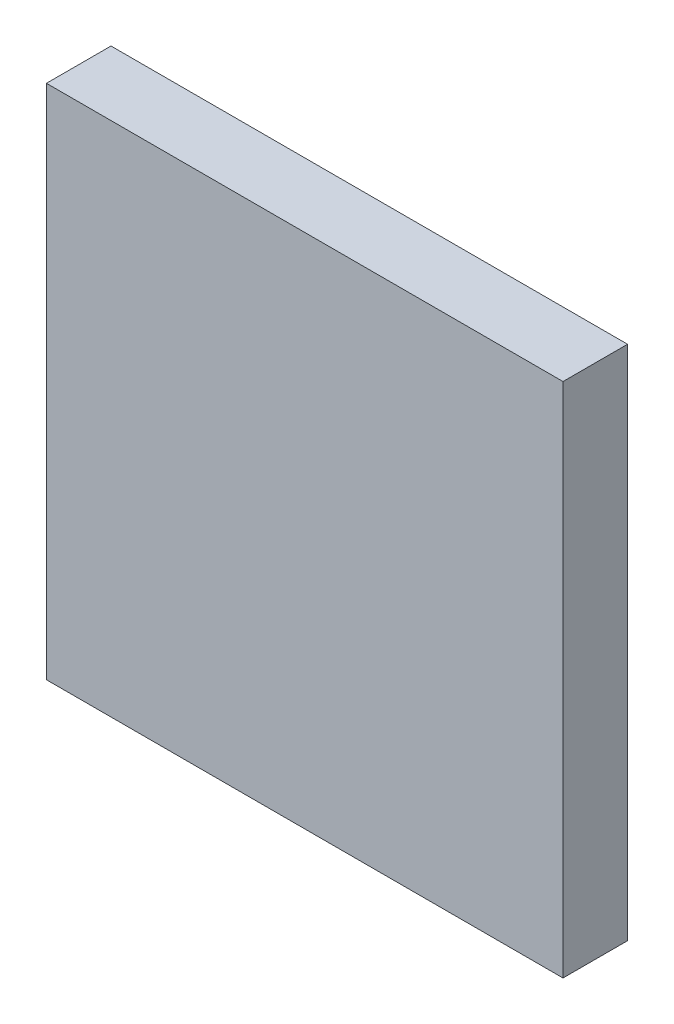
ISO-10303-21;
HEADER;
FILE_DESCRIPTION(('STEP AP214'),'2;1');
FILE_NAME('part.step','',(''),(''),'','','');
FILE_SCHEMA(('AUTOMOTIVE_DESIGN { 1 0 10303 214 1 1 1 1 }'));
ENDSEC;
DATA;
#1=APPLICATION_CONTEXT('core data for automotive mechanical design processes');
#2=APPLICATION_PROTOCOL_DEFINITION('international standard','automotive_design',2000,#1);
#3=PRODUCT_CONTEXT('',#1,'mechanical');
#4=PRODUCT('Part','Part','',(#3));
#5=PRODUCT_RELATED_PRODUCT_CATEGORY('part','',(#4));
#6=PRODUCT_DEFINITION_FORMATION('','',#4);
#7=PRODUCT_DEFINITION_CONTEXT('part definition',#1,'design');
#8=PRODUCT_DEFINITION('design','',#6,#7);
#9=PRODUCT_DEFINITION_SHAPE('','',#8);
#10=(LENGTH_UNIT() NAMED_UNIT(*) SI_UNIT(.MILLI.,.METRE.));
#11=(NAMED_UNIT(*) PLANE_ANGLE_UNIT() SI_UNIT($,.RADIAN.));
#12=(NAMED_UNIT(*) SI_UNIT($,.STERADIAN.) SOLID_ANGLE_UNIT());
#13=UNCERTAINTY_MEASURE_WITH_UNIT(LENGTH_MEASURE(1.E-05),#10,'distance_accuracy_value','');
#14=(GEOMETRIC_REPRESENTATION_CONTEXT(3) GLOBAL_UNCERTAINTY_ASSIGNED_CONTEXT((#13)) GLOBAL_UNIT_ASSIGNED_CONTEXT((#10,
#11,#12)) REPRESENTATION_CONTEXT('',''));
#15=CARTESIAN_POINT('',(0.,0.,0.));
#16=DIRECTION('',(0.,0.,1.));
#17=DIRECTION('',(1.,0.,0.));
#18=AXIS2_PLACEMENT_3D('',#15,#16,#17);
#19=CARTESIAN_POINT('',(-5.99999816,-6.0000007,1.49999954));
#20=DIRECTION('',(0.,0.,-1.));
#21=DIRECTION('',(-1.,0.,0.));
#22=AXIS2_PLACEMENT_3D('',#19,#20,#21);
#23=PLANE('',#22);
#24=DIRECTION('',(0.,1.,0.));
#25=VECTOR('',#24,1.);
#26=CARTESIAN_POINT('',(6.0000007,-6.0000007,1.49999954));
#27=LINE('',#26,#25);
#28=CARTESIAN_POINT('',(6.0000007,-6.0000007,1.49999954));
#29=VERTEX_POINT('',#28);
#30=CARTESIAN_POINT('',(6.0000007,6.0000007,1.49999954));
#31=VERTEX_POINT('',#30);
#32=EDGE_CURVE('E55',#29,#31,#27,.T.);
#33=ORIENTED_EDGE('',*,*,#32,.T.);
#34=DIRECTION('',(1.,0.,0.));
#35=VECTOR('',#34,1.);
#36=CARTESIAN_POINT('',(6.0000007,6.0000007,1.49999954));
#37=LINE('',#36,#35);
#38=CARTESIAN_POINT('',(-5.99999816,6.0000007,1.49999954));
#39=VERTEX_POINT('',#38);
#40=EDGE_CURVE('E57',#31,#39,#37,.F.);
#41=ORIENTED_EDGE('',*,*,#40,.T.);
#42=DIRECTION('',(0.,1.,0.));
#43=VECTOR('',#42,1.);
#44=CARTESIAN_POINT('',(-5.99999816,6.0000007,1.49999954));
#45=LINE('',#44,#43);
#46=CARTESIAN_POINT('',(-5.99999816,-6.0000007,1.49999954));
#47=VERTEX_POINT('',#46);
#48=EDGE_CURVE('E20',#39,#47,#45,.F.);
#49=ORIENTED_EDGE('',*,*,#48,.T.);
#50=DIRECTION('',(1.,0.,0.));
#51=VECTOR('',#50,1.);
#52=CARTESIAN_POINT('',(-5.99999816,-6.0000007,1.49999954));
#53=LINE('',#52,#51);
#54=EDGE_CURVE('E80',#47,#29,#53,.T.);
#55=ORIENTED_EDGE('',*,*,#54,.T.);
#56=EDGE_LOOP('',(#33,#41,#49,#55));
#57=FACE_BOUND('',#56,.T.);
#58=ADVANCED_FACE('F17',(#57),#23,.F.);
#59=CARTESIAN_POINT('',(-5.99999816,6.0000007,0.));
#60=DIRECTION('',(1.,0.,0.));
#61=DIRECTION('',(0.,0.,-1.));
#62=AXIS2_PLACEMENT_3D('',#59,#60,#61);
#63=PLANE('',#62);
#64=DIRECTION('',(0.,0.,1.));
#65=VECTOR('',#64,1.);
#66=CARTESIAN_POINT('',(-5.99999816,-6.0000007,0.));
#67=LINE('',#66,#65);
#68=CARTESIAN_POINT('',(-5.99999816,-6.0000007,0.));
#69=VERTEX_POINT('',#68);
#70=EDGE_CURVE('E68',#69,#47,#67,.T.);
#71=ORIENTED_EDGE('',*,*,#70,.T.);
#72=ORIENTED_EDGE('',*,*,#48,.F.);
#73=DIRECTION('',(0.,0.,-1.));
#74=VECTOR('',#73,1.);
#75=CARTESIAN_POINT('',(-5.99999816,6.0000007,0.));
#76=LINE('',#75,#74);
#77=CARTESIAN_POINT('',(-5.99999816,6.0000007,0.));
#78=VERTEX_POINT('',#77);
#79=EDGE_CURVE('E63',#39,#78,#76,.T.);
#80=ORIENTED_EDGE('',*,*,#79,.T.);
#81=DIRECTION('',(0.,1.,0.));
#82=VECTOR('',#81,1.);
#83=CARTESIAN_POINT('',(-5.99999816,-6.0000007,0.));
#84=LINE('',#83,#82);
#85=EDGE_CURVE('E83',#69,#78,#84,.T.);
#86=ORIENTED_EDGE('',*,*,#85,.F.);
#87=EDGE_LOOP('',(#71,#72,#80,#86));
#88=FACE_BOUND('',#87,.T.);
#89=ADVANCED_FACE('F65',(#88),#63,.F.);
#90=CARTESIAN_POINT('',(6.0000007,6.0000007,0.));
#91=DIRECTION('',(0.,-1.,0.));
#92=DIRECTION('',(0.,0.,-1.));
#93=AXIS2_PLACEMENT_3D('',#90,#91,#92);
#94=PLANE('',#93);
#95=ORIENTED_EDGE('',*,*,#79,.F.);
#96=ORIENTED_EDGE('',*,*,#40,.F.);
#97=DIRECTION('',(0.,0.,1.));
#98=VECTOR('',#97,1.);
#99=CARTESIAN_POINT('',(6.0000007,6.0000007,0.));
#100=LINE('',#99,#98);
#101=CARTESIAN_POINT('',(6.0000007,6.0000007,0.));
#102=VERTEX_POINT('',#101);
#103=EDGE_CURVE('E75',#31,#102,#100,.F.);
#104=ORIENTED_EDGE('',*,*,#103,.T.);
#105=DIRECTION('',(-1.,0.,0.));
#106=VECTOR('',#105,1.);
#107=CARTESIAN_POINT('',(-5.99999816,6.0000007,0.));
#108=LINE('',#107,#106);
#109=EDGE_CURVE('E72',#78,#102,#108,.F.);
#110=ORIENTED_EDGE('',*,*,#109,.F.);
#111=EDGE_LOOP('',(#95,#96,#104,#110));
#112=FACE_BOUND('',#111,.T.);
#113=ADVANCED_FACE('F70',(#112),#94,.F.);
#114=CARTESIAN_POINT('',(6.0000007,-6.0000007,0.));
#115=DIRECTION('',(-1.,0.,0.));
#116=DIRECTION('',(0.,0.,1.));
#117=AXIS2_PLACEMENT_3D('',#114,#115,#116);
#118=PLANE('',#117);
#119=ORIENTED_EDGE('',*,*,#103,.F.);
#120=ORIENTED_EDGE('',*,*,#32,.F.);
#121=DIRECTION('',(0.,0.,1.));
#122=VECTOR('',#121,1.);
#123=CARTESIAN_POINT('',(6.0000007,-6.0000007,0.));
#124=LINE('',#123,#122);
#125=CARTESIAN_POINT('',(6.0000007,-6.0000007,0.));
#126=VERTEX_POINT('',#125);
#127=EDGE_CURVE('E35',#29,#126,#124,.F.);
#128=ORIENTED_EDGE('',*,*,#127,.T.);
#129=DIRECTION('',(0.,1.,0.));
#130=VECTOR('',#129,1.);
#131=CARTESIAN_POINT('',(6.0000007,-6.0000007,0.));
#132=LINE('',#131,#130);
#133=EDGE_CURVE('E26',#102,#126,#132,.F.);
#134=ORIENTED_EDGE('',*,*,#133,.F.);
#135=EDGE_LOOP('',(#119,#120,#128,#134));
#136=FACE_BOUND('',#135,.T.);
#137=ADVANCED_FACE('F89',(#136),#118,.F.);
#138=CARTESIAN_POINT('',(-5.99999816,-6.0000007,0.));
#139=DIRECTION('',(0.,1.,0.));
#140=DIRECTION('',(0.,0.,1.));
#141=AXIS2_PLACEMENT_3D('',#138,#139,#140);
#142=PLANE('',#141);
#143=ORIENTED_EDGE('',*,*,#127,.F.);
#144=ORIENTED_EDGE('',*,*,#54,.F.);
#145=ORIENTED_EDGE('',*,*,#70,.F.);
#146=DIRECTION('',(-1.,0.,0.));
#147=VECTOR('',#146,1.);
#148=CARTESIAN_POINT('',(-5.99999816,-6.0000007,0.));
#149=LINE('',#148,#147);
#150=EDGE_CURVE('E11',#126,#69,#149,.T.);
#151=ORIENTED_EDGE('',*,*,#150,.F.);
#152=EDGE_LOOP('',(#143,#144,#145,#151));
#153=FACE_BOUND('',#152,.T.);
#154=ADVANCED_FACE('F91',(#153),#142,.F.);
#155=CARTESIAN_POINT('',(-5.99999816,-6.0000007,0.));
#156=DIRECTION('',(0.,0.,-1.));
#157=DIRECTION('',(-1.,0.,0.));
#158=AXIS2_PLACEMENT_3D('',#155,#156,#157);
#159=PLANE('',#158);
#160=ORIENTED_EDGE('',*,*,#133,.T.);
#161=ORIENTED_EDGE('',*,*,#150,.T.);
#162=ORIENTED_EDGE('',*,*,#85,.T.);
#163=ORIENTED_EDGE('',*,*,#109,.T.);
#164=EDGE_LOOP('',(#160,#161,#162,#163));
#165=FACE_BOUND('',#164,.T.);
#166=ADVANCED_FACE('F88',(#165),#159,.T.);
#167=CLOSED_SHELL('',(#58,#89,#113,#137,#154,#166));
#168=MANIFOLD_SOLID_BREP('B1',#167);
#169=ADVANCED_BREP_SHAPE_REPRESENTATION('',(#18,#168),#14);
#170=SHAPE_DEFINITION_REPRESENTATION(#9,#169);
ENDSEC;
END-ISO-10303-21;
